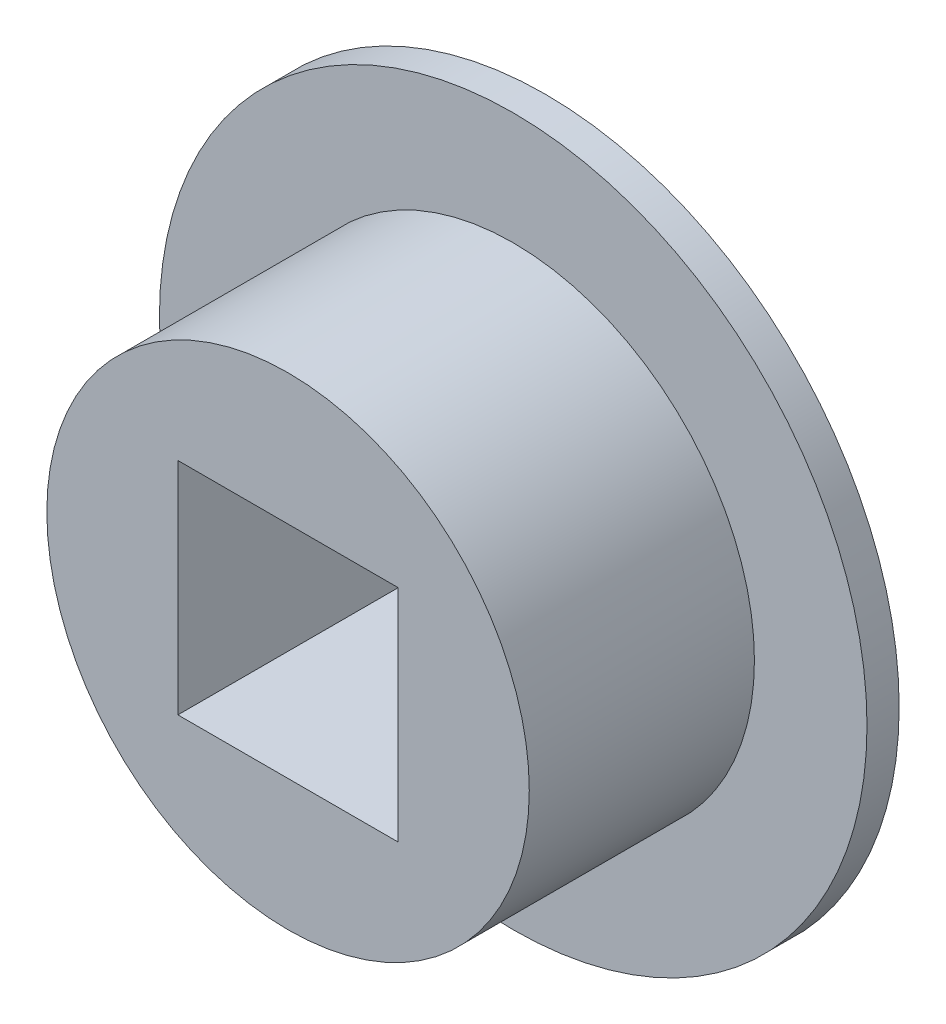
ISO-10303-21;
HEADER;
FILE_DESCRIPTION(('STEP AP214'),'2;1');
FILE_NAME('part.step','',(''),(''),'','','');
FILE_SCHEMA(('AUTOMOTIVE_DESIGN { 1 0 10303 214 1 1 1 1 }'));
ENDSEC;
DATA;
#1=APPLICATION_CONTEXT('core data for automotive mechanical design processes');
#2=APPLICATION_PROTOCOL_DEFINITION('international standard','automotive_design',2000,#1);
#3=PRODUCT_CONTEXT('',#1,'mechanical');
#4=PRODUCT('Part','Part','',(#3));
#5=PRODUCT_RELATED_PRODUCT_CATEGORY('part','',(#4));
#6=PRODUCT_DEFINITION_FORMATION('','',#4);
#7=PRODUCT_DEFINITION_CONTEXT('part definition',#1,'design');
#8=PRODUCT_DEFINITION('design','',#6,#7);
#9=PRODUCT_DEFINITION_SHAPE('','',#8);
#10=(LENGTH_UNIT() NAMED_UNIT(*) SI_UNIT(.MILLI.,.METRE.));
#11=(NAMED_UNIT(*) PLANE_ANGLE_UNIT() SI_UNIT($,.RADIAN.));
#12=(NAMED_UNIT(*) SI_UNIT($,.STERADIAN.) SOLID_ANGLE_UNIT());
#13=UNCERTAINTY_MEASURE_WITH_UNIT(LENGTH_MEASURE(1.E-05),#10,'distance_accuracy_value','');
#14=(GEOMETRIC_REPRESENTATION_CONTEXT(3) GLOBAL_UNCERTAINTY_ASSIGNED_CONTEXT((#13)) GLOBAL_UNIT_ASSIGNED_CONTEXT((#10,
#11,#12)) REPRESENTATION_CONTEXT('',''));
#15=CARTESIAN_POINT('',(0.,0.,0.));
#16=DIRECTION('',(0.,0.,1.));
#17=DIRECTION('',(1.,0.,0.));
#18=AXIS2_PLACEMENT_3D('',#15,#16,#17);
#19=CARTESIAN_POINT('',(0.,0.,4.));
#20=DIRECTION('',(0.,0.,-1.));
#21=DIRECTION('',(-1.,0.,0.));
#22=AXIS2_PLACEMENT_3D('',#19,#20,#21);
#23=CYLINDRICAL_SURFACE('',#22,7.5);
#24=CARTESIAN_POINT('',(0.,0.,4.));
#25=DIRECTION('',(0.,0.,1.));
#26=DIRECTION('',(1.,0.,0.));
#27=AXIS2_PLACEMENT_3D('',#24,#25,#26);
#28=CIRCLE('',#27,7.5);
#29=CARTESIAN_POINT('',(7.5,0.,4.));
#30=VERTEX_POINT('',#29);
#31=EDGE_CURVE('E46',#30,#30,#28,.T.);
#32=ORIENTED_EDGE('',*,*,#31,.F.);
#33=EDGE_LOOP('',(#32));
#34=FACE_BOUND('',#33,.T.);
#35=CARTESIAN_POINT('',(0.,0.,-3.));
#36=DIRECTION('',(0.,0.,-1.));
#37=DIRECTION('',(-1.,0.,0.));
#38=AXIS2_PLACEMENT_3D('',#35,#36,#37);
#39=CIRCLE('',#38,7.5);
#40=CARTESIAN_POINT('',(-7.5,0.,-3.));
#41=VERTEX_POINT('',#40);
#42=EDGE_CURVE('E11',#41,#41,#39,.T.);
#43=ORIENTED_EDGE('',*,*,#42,.F.);
#44=EDGE_LOOP('',(#43));
#45=FACE_BOUND('',#44,.T.);
#46=ADVANCED_FACE('F39',(#34,#45),#23,.T.);
#47=CARTESIAN_POINT('',(0.,0.,4.));
#48=DIRECTION('',(0.,0.,1.));
#49=DIRECTION('',(1.,0.,0.));
#50=AXIS2_PLACEMENT_3D('',#47,#48,#49);
#51=PLANE('',#50);
#52=ORIENTED_EDGE('',*,*,#31,.T.);
#53=EDGE_LOOP('',(#52));
#54=FACE_BOUND('',#53,.T.);
#55=DIRECTION('',(-1.,0.,0.));
#56=VECTOR('',#55,1.);
#57=CARTESIAN_POINT('',(-3.425,3.425,4.));
#58=LINE('',#57,#56);
#59=CARTESIAN_POINT('',(3.425,3.425,4.));
#60=VERTEX_POINT('',#59);
#61=CARTESIAN_POINT('',(-3.425,3.425,4.));
#62=VERTEX_POINT('',#61);
#63=EDGE_CURVE('E87',#60,#62,#58,.T.);
#64=ORIENTED_EDGE('',*,*,#63,.F.);
#65=DIRECTION('',(0.,1.,0.));
#66=VECTOR('',#65,1.);
#67=CARTESIAN_POINT('',(3.425,-3.425,4.));
#68=LINE('',#67,#66);
#69=CARTESIAN_POINT('',(3.425,-3.425,4.));
#70=VERTEX_POINT('',#69);
#71=EDGE_CURVE('E79',#70,#60,#68,.T.);
#72=ORIENTED_EDGE('',*,*,#71,.F.);
#73=DIRECTION('',(1.,0.,0.));
#74=VECTOR('',#73,1.);
#75=CARTESIAN_POINT('',(-3.425,-3.425,4.));
#76=LINE('',#75,#74);
#77=CARTESIAN_POINT('',(-3.425,-3.425,4.));
#78=VERTEX_POINT('',#77);
#79=EDGE_CURVE('E101',#78,#70,#76,.T.);
#80=ORIENTED_EDGE('',*,*,#79,.F.);
#81=DIRECTION('',(0.,-1.,0.));
#82=VECTOR('',#81,1.);
#83=CARTESIAN_POINT('',(-3.425,-3.425,4.));
#84=LINE('',#83,#82);
#85=EDGE_CURVE('E99',#62,#78,#84,.T.);
#86=ORIENTED_EDGE('',*,*,#85,.F.);
#87=EDGE_LOOP('',(#64,#72,#80,#86));
#88=FACE_BOUND('',#87,.T.);
#89=ADVANCED_FACE('F98',(#54,#88),#51,.T.);
#90=CARTESIAN_POINT('',(0.,0.,-4.));
#91=DIRECTION('',(0.,0.,1.));
#92=DIRECTION('',(1.,0.,0.));
#93=AXIS2_PLACEMENT_3D('',#90,#91,#92);
#94=PLANE('',#93);
#95=DIRECTION('',(0.,1.,0.));
#96=VECTOR('',#95,1.);
#97=CARTESIAN_POINT('',(3.425,-3.425,-4.));
#98=LINE('',#97,#96);
#99=CARTESIAN_POINT('',(3.425,-3.425,-4.));
#100=VERTEX_POINT('',#99);
#101=CARTESIAN_POINT('',(3.425,3.425,-4.));
#102=VERTEX_POINT('',#101);
#103=EDGE_CURVE('E61',#100,#102,#98,.T.);
#104=ORIENTED_EDGE('',*,*,#103,.T.);
#105=DIRECTION('',(-1.,0.,0.));
#106=VECTOR('',#105,1.);
#107=CARTESIAN_POINT('',(-3.425,3.425,-4.));
#108=LINE('',#107,#106);
#109=CARTESIAN_POINT('',(-3.425,3.425,-4.));
#110=VERTEX_POINT('',#109);
#111=EDGE_CURVE('E94',#102,#110,#108,.T.);
#112=ORIENTED_EDGE('',*,*,#111,.T.);
#113=DIRECTION('',(0.,-1.,0.));
#114=VECTOR('',#113,1.);
#115=CARTESIAN_POINT('',(-3.425,-3.425,-4.));
#116=LINE('',#115,#114);
#117=CARTESIAN_POINT('',(-3.425,-3.425,-4.));
#118=VERTEX_POINT('',#117);
#119=EDGE_CURVE('E109',#110,#118,#116,.T.);
#120=ORIENTED_EDGE('',*,*,#119,.T.);
#121=DIRECTION('',(1.,0.,0.));
#122=VECTOR('',#121,1.);
#123=CARTESIAN_POINT('',(-3.425,-3.425,-4.));
#124=LINE('',#123,#122);
#125=EDGE_CURVE('E88',#118,#100,#124,.T.);
#126=ORIENTED_EDGE('',*,*,#125,.T.);
#127=EDGE_LOOP('',(#104,#112,#120,#126));
#128=FACE_BOUND('',#127,.T.);
#129=CARTESIAN_POINT('',(0.,0.,-4.));
#130=DIRECTION('',(0.,0.,-1.));
#131=DIRECTION('',(-1.,0.,0.));
#132=AXIS2_PLACEMENT_3D('',#129,#130,#131);
#133=CIRCLE('',#132,11.);
#134=CARTESIAN_POINT('',(-11.,0.,-4.));
#135=VERTEX_POINT('',#134);
#136=EDGE_CURVE('E132',#135,#135,#133,.T.);
#137=ORIENTED_EDGE('',*,*,#136,.T.);
#138=EDGE_LOOP('',(#137));
#139=FACE_BOUND('',#138,.T.);
#140=ADVANCED_FACE('F137',(#128,#139),#94,.F.);
#141=CARTESIAN_POINT('',(3.425,-3.425,4.));
#142=DIRECTION('',(-1.,0.,0.));
#143=DIRECTION('',(0.,0.,1.));
#144=AXIS2_PLACEMENT_3D('',#141,#142,#143);
#145=PLANE('',#144);
#146=ORIENTED_EDGE('',*,*,#103,.F.);
#147=DIRECTION('',(0.,0.,-1.));
#148=VECTOR('',#147,1.);
#149=CARTESIAN_POINT('',(3.425,-3.425,4.));
#150=LINE('',#149,#148);
#151=EDGE_CURVE('E83',#70,#100,#150,.T.);
#152=ORIENTED_EDGE('',*,*,#151,.F.);
#153=ORIENTED_EDGE('',*,*,#71,.T.);
#154=DIRECTION('',(0.,0.,-1.));
#155=VECTOR('',#154,1.);
#156=CARTESIAN_POINT('',(3.425,3.425,4.));
#157=LINE('',#156,#155);
#158=EDGE_CURVE('E82',#60,#102,#157,.T.);
#159=ORIENTED_EDGE('',*,*,#158,.T.);
#160=EDGE_LOOP('',(#146,#152,#153,#159));
#161=FACE_BOUND('',#160,.T.);
#162=ADVANCED_FACE('F81',(#161),#145,.T.);
#163=CARTESIAN_POINT('',(-3.425,3.425,4.));
#164=DIRECTION('',(0.,-1.,0.));
#165=DIRECTION('',(0.,0.,-1.));
#166=AXIS2_PLACEMENT_3D('',#163,#164,#165);
#167=PLANE('',#166);
#168=ORIENTED_EDGE('',*,*,#111,.F.);
#169=ORIENTED_EDGE('',*,*,#158,.F.);
#170=ORIENTED_EDGE('',*,*,#63,.T.);
#171=DIRECTION('',(0.,0.,-1.));
#172=VECTOR('',#171,1.);
#173=CARTESIAN_POINT('',(-3.425,3.425,4.));
#174=LINE('',#173,#172);
#175=EDGE_CURVE('E95',#62,#110,#174,.T.);
#176=ORIENTED_EDGE('',*,*,#175,.T.);
#177=EDGE_LOOP('',(#168,#169,#170,#176));
#178=FACE_BOUND('',#177,.T.);
#179=ADVANCED_FACE('F91',(#178),#167,.T.);
#180=CARTESIAN_POINT('',(-3.425,-3.425,4.));
#181=DIRECTION('',(1.,0.,0.));
#182=DIRECTION('',(0.,0.,-1.));
#183=AXIS2_PLACEMENT_3D('',#180,#181,#182);
#184=PLANE('',#183);
#185=ORIENTED_EDGE('',*,*,#119,.F.);
#186=ORIENTED_EDGE('',*,*,#175,.F.);
#187=ORIENTED_EDGE('',*,*,#85,.T.);
#188=DIRECTION('',(0.,0.,-1.));
#189=VECTOR('',#188,1.);
#190=CARTESIAN_POINT('',(-3.425,-3.425,4.));
#191=LINE('',#190,#189);
#192=EDGE_CURVE('E53',#78,#118,#191,.T.);
#193=ORIENTED_EDGE('',*,*,#192,.T.);
#194=EDGE_LOOP('',(#185,#186,#187,#193));
#195=FACE_BOUND('',#194,.T.);
#196=ADVANCED_FACE('F146',(#195),#184,.T.);
#197=CARTESIAN_POINT('',(-3.425,-3.425,4.));
#198=DIRECTION('',(0.,1.,0.));
#199=DIRECTION('',(0.,0.,1.));
#200=AXIS2_PLACEMENT_3D('',#197,#198,#199);
#201=PLANE('',#200);
#202=ORIENTED_EDGE('',*,*,#125,.F.);
#203=ORIENTED_EDGE('',*,*,#192,.F.);
#204=ORIENTED_EDGE('',*,*,#79,.T.);
#205=ORIENTED_EDGE('',*,*,#151,.T.);
#206=EDGE_LOOP('',(#202,#203,#204,#205));
#207=FACE_BOUND('',#206,.T.);
#208=ADVANCED_FACE('F140',(#207),#201,.T.);
#209=CARTESIAN_POINT('',(0.,0.,-3.));
#210=DIRECTION('',(0.,0.,-1.));
#211=DIRECTION('',(-1.,0.,0.));
#212=AXIS2_PLACEMENT_3D('',#209,#210,#211);
#213=CYLINDRICAL_SURFACE('',#212,11.);
#214=CARTESIAN_POINT('',(0.,0.,-3.));
#215=DIRECTION('',(0.,0.,-1.));
#216=DIRECTION('',(-1.,0.,0.));
#217=AXIS2_PLACEMENT_3D('',#214,#215,#216);
#218=CIRCLE('',#217,11.);
#219=CARTESIAN_POINT('',(-11.,0.,-3.));
#220=VERTEX_POINT('',#219);
#221=EDGE_CURVE('E107',#220,#220,#218,.T.);
#222=ORIENTED_EDGE('',*,*,#221,.T.);
#223=EDGE_LOOP('',(#222));
#224=FACE_BOUND('',#223,.T.);
#225=ORIENTED_EDGE('',*,*,#136,.F.);
#226=EDGE_LOOP('',(#225));
#227=FACE_BOUND('',#226,.T.);
#228=ADVANCED_FACE('F127',(#224,#227),#213,.T.);
#229=CARTESIAN_POINT('',(0.,0.,-3.));
#230=DIRECTION('',(0.,0.,-1.));
#231=DIRECTION('',(-1.,0.,0.));
#232=AXIS2_PLACEMENT_3D('',#229,#230,#231);
#233=PLANE('',#232);
#234=ORIENTED_EDGE('',*,*,#42,.T.);
#235=EDGE_LOOP('',(#234));
#236=FACE_BOUND('',#235,.T.);
#237=ORIENTED_EDGE('',*,*,#221,.F.);
#238=EDGE_LOOP('',(#237));
#239=FACE_BOUND('',#238,.T.);
#240=ADVANCED_FACE('F124',(#236,#239),#233,.F.);
#241=CLOSED_SHELL('',(#46,#89,#140,#162,#179,#196,#208,#228,#240));
#242=MANIFOLD_SOLID_BREP('B2',#241);
#243=ADVANCED_BREP_SHAPE_REPRESENTATION('',(#18,#242),#14);
#244=SHAPE_DEFINITION_REPRESENTATION(#9,#243);
ENDSEC;
END-ISO-10303-21;
